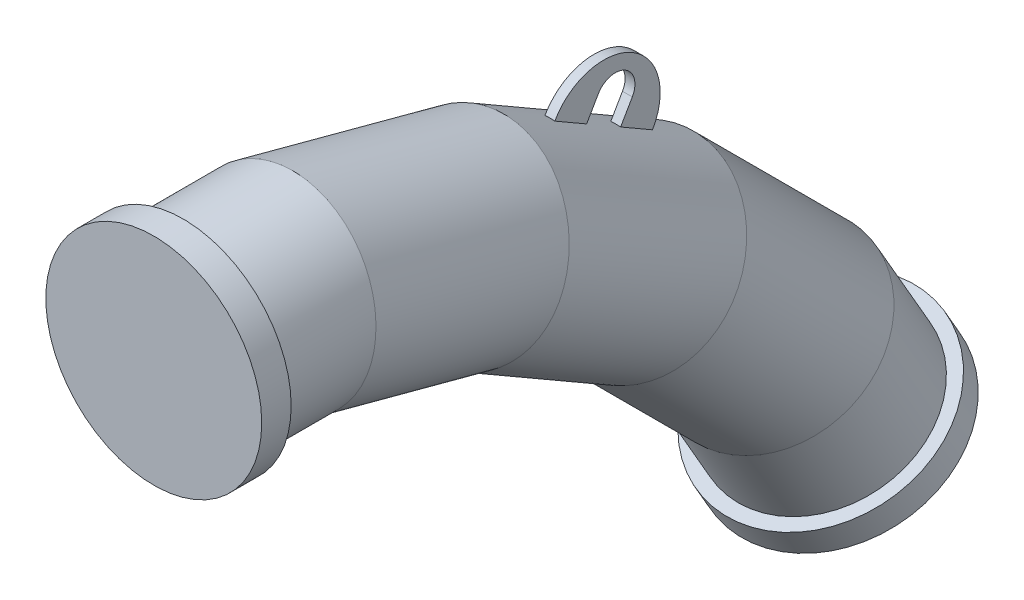
ISO-10303-21;
HEADER;
FILE_DESCRIPTION(('STEP AP214'),'2;1');
FILE_NAME('part.step','',(''),(''),'','','');
FILE_SCHEMA(('AUTOMOTIVE_DESIGN { 1 0 10303 214 1 1 1 1 }'));
ENDSEC;
DATA;
#1=APPLICATION_CONTEXT('core data for automotive mechanical design processes');
#2=APPLICATION_PROTOCOL_DEFINITION('international standard','automotive_design',2000,#1);
#3=PRODUCT_CONTEXT('',#1,'mechanical');
#4=PRODUCT('Part','Part','',(#3));
#5=PRODUCT_RELATED_PRODUCT_CATEGORY('part','',(#4));
#6=PRODUCT_DEFINITION_FORMATION('','',#4);
#7=PRODUCT_DEFINITION_CONTEXT('part definition',#1,'design');
#8=PRODUCT_DEFINITION('design','',#6,#7);
#9=PRODUCT_DEFINITION_SHAPE('','',#8);
#10=(LENGTH_UNIT() NAMED_UNIT(*) SI_UNIT(.MILLI.,.METRE.));
#11=(NAMED_UNIT(*) PLANE_ANGLE_UNIT() SI_UNIT($,.RADIAN.));
#12=(NAMED_UNIT(*) SI_UNIT($,.STERADIAN.) SOLID_ANGLE_UNIT());
#13=UNCERTAINTY_MEASURE_WITH_UNIT(LENGTH_MEASURE(1.E-05),#10,'distance_accuracy_value','');
#14=(GEOMETRIC_REPRESENTATION_CONTEXT(3) GLOBAL_UNCERTAINTY_ASSIGNED_CONTEXT((#13)) GLOBAL_UNIT_ASSIGNED_CONTEXT((#10,
#11,#12)) REPRESENTATION_CONTEXT('',''));
#15=CARTESIAN_POINT('',(0.,0.,0.));
#16=DIRECTION('',(0.,0.,1.));
#17=DIRECTION('',(1.,0.,0.));
#18=AXIS2_PLACEMENT_3D('',#15,#16,#17);
#19=CARTESIAN_POINT('',(0.,-400.980762113535,-694.519052838327));
#20=DIRECTION('',(0.,-0.866025403784441,-0.499999999999997));
#21=DIRECTION('',(-0.999999999999999,0.,0.));
#22=AXIS2_PLACEMENT_3D('',#19,#20,#21);
#23=PLANE('',#22);
#24=CARTESIAN_POINT('',(0.,-400.980762113535,-694.519052838327));
#25=DIRECTION('',(0.,-0.866025403784441,-0.499999999999997));
#26=DIRECTION('',(-0.999999999999999,0.,0.));
#27=AXIS2_PLACEMENT_3D('',#24,#25,#26);
#28=CIRCLE('',#27,110.);
#29=CARTESIAN_POINT('',(-110.,-400.980762113535,-694.519052838327));
#30=VERTEX_POINT('',#29);
#31=EDGE_CURVE('E20',#30,#30,#28,.T.);
#32=ORIENTED_EDGE('',*,*,#31,.T.);
#33=EDGE_LOOP('',(#32));
#34=FACE_BOUND('',#33,.T.);
#35=ADVANCED_FACE('F16',(#34),#23,.T.);
#36=CARTESIAN_POINT('',(0.,-375.000000000002,-679.519052838328));
#37=DIRECTION('',(0.,-0.866025403784441,-0.499999999999997));
#38=DIRECTION('',(-0.999999999999999,0.,0.));
#39=AXIS2_PLACEMENT_3D('',#36,#37,#38);
#40=CYLINDRICAL_SURFACE('',#39,110.);
#41=CARTESIAN_POINT('',(0.,-375.000000000002,-679.519052838328));
#42=DIRECTION('',(0.,-0.866025403784441,-0.499999999999997));
#43=DIRECTION('',(-0.999999999999999,0.,0.));
#44=AXIS2_PLACEMENT_3D('',#41,#42,#43);
#45=CIRCLE('',#44,110.);
#46=CARTESIAN_POINT('',(-110.,-375.000000000002,-679.519052838328));
#47=VERTEX_POINT('',#46);
#48=EDGE_CURVE('E26',#47,#47,#45,.T.);
#49=ORIENTED_EDGE('',*,*,#48,.T.);
#50=EDGE_LOOP('',(#49));
#51=FACE_BOUND('',#50,.T.);
#52=ORIENTED_EDGE('',*,*,#31,.F.);
#53=EDGE_LOOP('',(#52));
#54=FACE_BOUND('',#53,.T.);
#55=ADVANCED_FACE('F18',(#51,#54),#40,.T.);
#56=CARTESIAN_POINT('',(0.,-375.000000000002,-679.519052838328));
#57=DIRECTION('',(0.,-0.866025403784441,-0.499999999999997));
#58=DIRECTION('',(-0.999999999999999,0.,0.));
#59=AXIS2_PLACEMENT_3D('',#56,#57,#58);
#60=PLANE('',#59);
#61=CARTESIAN_POINT('',(0.,-375.000000000002,-679.519052838327));
#62=DIRECTION('',(0.,0.866025403784439,0.499999999999997));
#63=DIRECTION('',(1.,0.,0.));
#64=AXIS2_PLACEMENT_3D('',#61,#62,#63);
#65=CIRCLE('',#64,96.85);
#66=CARTESIAN_POINT('',(96.8499999999999,-375.000000000002,-679.519052838327));
#67=VERTEX_POINT('',#66);
#68=EDGE_CURVE('E10',#67,#67,#65,.T.);
#69=ORIENTED_EDGE('',*,*,#68,.F.);
#70=EDGE_LOOP('',(#69));
#71=FACE_BOUND('',#70,.T.);
#72=ORIENTED_EDGE('',*,*,#48,.F.);
#73=EDGE_LOOP('',(#72));
#74=FACE_BOUND('',#73,.T.);
#75=ADVANCED_FACE('F158',(#71,#74),#60,.F.);
#76=CARTESIAN_POINT('',(5.,3.8751139943531,-465.25));
#77=DIRECTION('',(1.,0.,0.));
#78=DIRECTION('',(0.,0.866025403784438,-0.500000000000001));
#79=AXIS2_PLACEMENT_3D('',#76,#77,#78);
#80=PLANE('',#79);
#81=DIRECTION('',(0.,0.866025403784438,-0.500000000000001));
#82=VECTOR('',#81,1.);
#83=CARTESIAN_POINT('',(5.00000000000002,3.61326296757457,-398.703539282395));
#84=LINE('',#83,#82);
#85=CARTESIAN_POINT('',(5.00000000000002,12.0317645601862,-403.563963443062));
#86=VERTEX_POINT('',#85);
#87=CARTESIAN_POINT('',(5.00000000000001,12.2735170054189,-403.703539282395));
#88=VERTEX_POINT('',#87);
#89=EDGE_CURVE('E120',#86,#88,#84,.T.);
#90=ORIENTED_EDGE('',*,*,#89,.F.);
#91=DIRECTION('',(0.,-0.500000000000001,-0.866025403784437));
#92=VECTOR('',#91,1.);
#93=CARTESIAN_POINT('',(5.00000000000005,32.6514511554609,-367.849618623899));
#94=LINE('',#93,#92);
#95=CARTESIAN_POINT('',(5.00000000000003,-6.71823543981404,-436.039916084979));
#96=VERTEX_POINT('',#95);
#97=EDGE_CURVE('E51',#86,#96,#94,.T.);
#98=ORIENTED_EDGE('',*,*,#97,.T.);
#99=DIRECTION('',(0.,0.866025403784438,-0.500000000000001));
#100=VECTOR('',#99,1.);
#101=CARTESIAN_POINT('',(5.00000000000001,-6.47648299458115,-436.179491924311));
#102=LINE('',#101,#100);
#103=CARTESIAN_POINT('',(5.00000000000001,13.8751139943533,-447.929491924311));
#104=VERTEX_POINT('',#103);
#105=EDGE_CURVE('E552',#96,#104,#102,.T.);
#106=ORIENTED_EDGE('',*,*,#105,.T.);
#107=CARTESIAN_POINT('',(5.,3.8751139943531,-465.25));
#108=DIRECTION('',(-1.,0.,0.));
#109=DIRECTION('',(0.,0.866025403784438,-0.500000000000001));
#110=AXIS2_PLACEMENT_3D('',#107,#108,#109);
#111=CIRCLE('',#110,20.);
#112=CARTESIAN_POINT('',(5.,-6.1248860056468,-482.570508075689));
#113=VERTEX_POINT('',#112);
#114=EDGE_CURVE('E559',#104,#113,#111,.T.);
#115=ORIENTED_EDGE('',*,*,#114,.T.);
#116=DIRECTION('',(0.,-0.866025403784438,0.500000000000001));
#117=VECTOR('',#116,1.);
#118=CARTESIAN_POINT('',(5.,-26.4764829945811,-470.820508075689));
#119=LINE('',#118,#117);
#120=CARTESIAN_POINT('',(5.00000000000003,-26.7182354398141,-470.680932236356));
#121=VERTEX_POINT('',#120);
#122=EDGE_CURVE('E573',#113,#121,#119,.T.);
#123=ORIENTED_EDGE('',*,*,#122,.T.);
#124=CARTESIAN_POINT('',(4.99999999999999,-45.4682354398142,-503.156884878273));
#125=VERTEX_POINT('',#124);
#126=EDGE_CURVE('E579',#121,#125,#94,.T.);
#127=ORIENTED_EDGE('',*,*,#126,.T.);
#128=DIRECTION('',(0.,0.866025403784438,-0.500000000000001));
#129=VECTOR('',#128,1.);
#130=CARTESIAN_POINT('',(4.99999999999999,-53.8867370324257,-498.296460717605));
#131=LINE('',#130,#129);
#132=CARTESIAN_POINT('',(4.99999999999999,-45.2264829945813,-503.296460717605));
#133=VERTEX_POINT('',#132);
#134=EDGE_CURVE('E119',#125,#133,#131,.T.);
#135=ORIENTED_EDGE('',*,*,#134,.T.);
#136=CARTESIAN_POINT('',(5.,-16.476482994581,-453.5));
#137=DIRECTION('',(1.,0.,0.));
#138=DIRECTION('',(0.,0.866025403784438,-0.500000000000001));
#139=AXIS2_PLACEMENT_3D('',#136,#137,#138);
#140=CIRCLE('',#139,57.5);
#141=EDGE_CURVE('E567',#133,#88,#140,.T.);
#142=ORIENTED_EDGE('',*,*,#141,.T.);
#143=EDGE_LOOP('',(#90,#98,#106,#115,#123,#127,#135,#142));
#144=FACE_BOUND('',#143,.T.);
#145=ADVANCED_FACE('F160',(#144),#80,.T.);
#146=CARTESIAN_POINT('',(-5.,3.8751139943531,-465.25));
#147=DIRECTION('',(1.,0.,0.));
#148=DIRECTION('',(0.,0.866025403784438,-0.500000000000001));
#149=AXIS2_PLACEMENT_3D('',#146,#147,#148);
#150=PLANE('',#149);
#151=DIRECTION('',(0.,-0.500000000000001,-0.866025403784437));
#152=VECTOR('',#151,1.);
#153=CARTESIAN_POINT('',(-4.99999999999995,32.6514511554609,-367.849618623899));
#154=LINE('',#153,#152);
#155=CARTESIAN_POINT('',(-4.99999999999999,12.0317645601862,-403.563963443062));
#156=VERTEX_POINT('',#155);
#157=CARTESIAN_POINT('',(-4.99999999999997,-6.71823543981404,-436.039916084979));
#158=VERTEX_POINT('',#157);
#159=EDGE_CURVE('E124',#156,#158,#154,.T.);
#160=ORIENTED_EDGE('',*,*,#159,.F.);
#161=DIRECTION('',(0.,0.866025403784438,-0.500000000000001));
#162=VECTOR('',#161,1.);
#163=CARTESIAN_POINT('',(-4.99999999999999,3.61326296757457,-398.703539282395));
#164=LINE('',#163,#162);
#165=CARTESIAN_POINT('',(-4.99999999999999,12.2735170054189,-403.703539282395));
#166=VERTEX_POINT('',#165);
#167=EDGE_CURVE('E108',#156,#166,#164,.T.);
#168=ORIENTED_EDGE('',*,*,#167,.T.);
#169=CARTESIAN_POINT('',(-5.,-16.476482994581,-453.5));
#170=DIRECTION('',(1.,0.,0.));
#171=DIRECTION('',(0.,0.866025403784438,-0.500000000000001));
#172=AXIS2_PLACEMENT_3D('',#169,#170,#171);
#173=CIRCLE('',#172,57.5);
#174=CARTESIAN_POINT('',(-5.00000000000001,-45.2264829945813,-503.296460717605));
#175=VERTEX_POINT('',#174);
#176=EDGE_CURVE('E546',#175,#166,#173,.T.);
#177=ORIENTED_EDGE('',*,*,#176,.F.);
#178=DIRECTION('',(0.,0.866025403784438,-0.500000000000001));
#179=VECTOR('',#178,1.);
#180=CARTESIAN_POINT('',(-5.00000000000001,-53.8867370324257,-498.296460717605));
#181=LINE('',#180,#179);
#182=CARTESIAN_POINT('',(-5.00000000000001,-45.4682354398142,-503.156884878273));
#183=VERTEX_POINT('',#182);
#184=EDGE_CURVE('E576',#183,#175,#181,.T.);
#185=ORIENTED_EDGE('',*,*,#184,.F.);
#186=CARTESIAN_POINT('',(-4.99999999999997,-26.7182354398141,-470.680932236356));
#187=VERTEX_POINT('',#186);
#188=EDGE_CURVE('E133',#187,#183,#154,.T.);
#189=ORIENTED_EDGE('',*,*,#188,.F.);
#190=DIRECTION('',(0.,-0.866025403784438,0.500000000000001));
#191=VECTOR('',#190,1.);
#192=CARTESIAN_POINT('',(-5.,-26.4764829945811,-470.820508075689));
#193=LINE('',#192,#191);
#194=CARTESIAN_POINT('',(-5.,-6.1248860056468,-482.570508075689));
#195=VERTEX_POINT('',#194);
#196=EDGE_CURVE('E553',#195,#187,#193,.T.);
#197=ORIENTED_EDGE('',*,*,#196,.F.);
#198=CARTESIAN_POINT('',(-5.,3.8751139943531,-465.25));
#199=DIRECTION('',(-1.,0.,0.));
#200=DIRECTION('',(0.,0.866025403784438,-0.500000000000001));
#201=AXIS2_PLACEMENT_3D('',#198,#199,#200);
#202=CIRCLE('',#201,20.);
#203=CARTESIAN_POINT('',(-4.99999999999999,13.8751139943532,-447.929491924312));
#204=VERTEX_POINT('',#203);
#205=EDGE_CURVE('E561',#204,#195,#202,.T.);
#206=ORIENTED_EDGE('',*,*,#205,.F.);
#207=DIRECTION('',(0.,0.866025403784438,-0.500000000000001));
#208=VECTOR('',#207,1.);
#209=CARTESIAN_POINT('',(-4.99999999999999,-6.47648299458117,-436.179491924311));
#210=LINE('',#209,#208);
#211=EDGE_CURVE('E127',#158,#204,#210,.T.);
#212=ORIENTED_EDGE('',*,*,#211,.F.);
#213=EDGE_LOOP('',(#160,#168,#177,#185,#189,#197,#206,#212));
#214=FACE_BOUND('',#213,.T.);
#215=ADVANCED_FACE('F125',(#214),#150,.F.);
#216=CARTESIAN_POINT('',(5.00000000000001,-6.47648299458115,-436.179491924311));
#217=DIRECTION('',(0.,0.500000000000001,0.866025403784438));
#218=DIRECTION('',(0.,-0.866025403784438,0.500000000000001));
#219=AXIS2_PLACEMENT_3D('',#216,#217,#218);
#220=PLANE('',#219);
#221=CARTESIAN_POINT('',(-1.01043121632866E-13,-90.4809471616773,-387.679491924308));
#222=DIRECTION('',(0.,0.500000000000001,0.866025403784438));
#223=DIRECTION('',(0.,-0.866025403784438,0.500000000000001));
#224=AXIS2_PLACEMENT_3D('',#221,#222,#223);
#225=CIRCLE('',#224,96.85);
#226=EDGE_CURVE('E586',#158,#96,#225,.F.);
#227=ORIENTED_EDGE('',*,*,#226,.F.);
#228=ORIENTED_EDGE('',*,*,#211,.T.);
#229=DIRECTION('',(-1.,0.,0.));
#230=VECTOR('',#229,1.);
#231=CARTESIAN_POINT('',(5.00000000000001,13.8751139943533,-447.929491924311));
#232=LINE('',#231,#230);
#233=EDGE_CURVE('E137',#104,#204,#232,.T.);
#234=ORIENTED_EDGE('',*,*,#233,.F.);
#235=ORIENTED_EDGE('',*,*,#105,.F.);
#236=EDGE_LOOP('',(#227,#228,#234,#235));
#237=FACE_BOUND('',#236,.T.);
#238=ADVANCED_FACE('F321',(#237),#220,.F.);
#239=CARTESIAN_POINT('',(5.,3.8751139943531,-465.25));
#240=DIRECTION('',(-1.,0.,0.));
#241=DIRECTION('',(0.,-0.866025403784438,0.500000000000001));
#242=AXIS2_PLACEMENT_3D('',#239,#240,#241);
#243=CYLINDRICAL_SURFACE('',#242,20.);
#244=ORIENTED_EDGE('',*,*,#205,.T.);
#245=DIRECTION('',(-1.,0.,0.));
#246=VECTOR('',#245,1.);
#247=CARTESIAN_POINT('',(5.,-6.1248860056468,-482.570508075689));
#248=LINE('',#247,#246);
#249=EDGE_CURVE('E147',#113,#195,#248,.T.);
#250=ORIENTED_EDGE('',*,*,#249,.F.);
#251=ORIENTED_EDGE('',*,*,#114,.F.);
#252=ORIENTED_EDGE('',*,*,#233,.T.);
#253=EDGE_LOOP('',(#244,#250,#251,#252));
#254=FACE_BOUND('',#253,.T.);
#255=ADVANCED_FACE('F311',(#254),#243,.F.);
#256=CARTESIAN_POINT('',(5.,-26.4764829945811,-470.820508075689));
#257=DIRECTION('',(0.,-0.500000000000001,-0.866025403784438));
#258=DIRECTION('',(0.,0.866025403784438,-0.500000000000001));
#259=AXIS2_PLACEMENT_3D('',#256,#257,#258);
#260=PLANE('',#259);
#261=CARTESIAN_POINT('',(0.,-110.480947161677,-422.320508075685));
#262=DIRECTION('',(0.,-0.500000000000001,-0.866025403784438));
#263=DIRECTION('',(0.,0.866025403784438,-0.500000000000001));
#264=AXIS2_PLACEMENT_3D('',#261,#262,#263);
#265=CIRCLE('',#264,96.85);
#266=EDGE_CURVE('E39',#121,#187,#265,.F.);
#267=ORIENTED_EDGE('',*,*,#266,.F.);
#268=ORIENTED_EDGE('',*,*,#122,.F.);
#269=ORIENTED_EDGE('',*,*,#249,.T.);
#270=ORIENTED_EDGE('',*,*,#196,.T.);
#271=EDGE_LOOP('',(#267,#268,#269,#270));
#272=FACE_BOUND('',#271,.T.);
#273=ADVANCED_FACE('F309',(#272),#260,.F.);
#274=CARTESIAN_POINT('',(5.,-16.476482994581,-453.5));
#275=DIRECTION('',(-1.,0.,0.));
#276=DIRECTION('',(0.,-0.866025403784438,0.500000000000001));
#277=AXIS2_PLACEMENT_3D('',#274,#275,#276);
#278=CYLINDRICAL_SURFACE('',#277,57.5);
#279=ORIENTED_EDGE('',*,*,#176,.T.);
#280=DIRECTION('',(-1.,0.,0.));
#281=VECTOR('',#280,1.);
#282=CARTESIAN_POINT('',(5.00000000000001,12.2735170054189,-403.703539282395));
#283=LINE('',#282,#281);
#284=EDGE_CURVE('E114',#88,#166,#283,.T.);
#285=ORIENTED_EDGE('',*,*,#284,.F.);
#286=ORIENTED_EDGE('',*,*,#141,.F.);
#287=DIRECTION('',(-1.,0.,0.));
#288=VECTOR('',#287,1.);
#289=CARTESIAN_POINT('',(4.99999999999999,-45.2264829945813,-503.296460717605));
#290=LINE('',#289,#288);
#291=EDGE_CURVE('E549',#133,#175,#290,.T.);
#292=ORIENTED_EDGE('',*,*,#291,.T.);
#293=EDGE_LOOP('',(#279,#285,#286,#292));
#294=FACE_BOUND('',#293,.T.);
#295=ADVANCED_FACE('F204',(#294),#278,.T.);
#296=CARTESIAN_POINT('',(-5.00000000000001,-53.8867370324257,-498.296460717605));
#297=DIRECTION('',(0.,0.500000000000001,0.866025403784438));
#298=DIRECTION('',(0.,-0.866025403784438,0.500000000000001));
#299=AXIS2_PLACEMENT_3D('',#296,#297,#298);
#300=PLANE('',#299);
#301=CARTESIAN_POINT('',(0.,-129.230947161678,-454.796460717602));
#302=DIRECTION('',(0.,0.500000000000001,0.866025403784438));
#303=DIRECTION('',(0.,-0.866025403784438,0.500000000000001));
#304=AXIS2_PLACEMENT_3D('',#301,#302,#303);
#305=CIRCLE('',#304,96.85);
#306=EDGE_CURVE('E580',#183,#125,#305,.F.);
#307=ORIENTED_EDGE('',*,*,#306,.F.);
#308=ORIENTED_EDGE('',*,*,#184,.T.);
#309=ORIENTED_EDGE('',*,*,#291,.F.);
#310=ORIENTED_EDGE('',*,*,#134,.F.);
#311=EDGE_LOOP('',(#307,#308,#309,#310));
#312=FACE_BOUND('',#311,.T.);
#313=ADVANCED_FACE('F208',(#312),#300,.F.);
#314=CARTESIAN_POINT('',(5.00000000000002,3.61326296757457,-398.703539282395));
#315=DIRECTION('',(0.,-0.500000000000001,-0.866025403784438));
#316=DIRECTION('',(0.,0.866025403784438,-0.500000000000001));
#317=AXIS2_PLACEMENT_3D('',#314,#315,#316);
#318=PLANE('',#317);
#319=CARTESIAN_POINT('',(-1.04568404931757E-13,-71.7309471616772,-355.203539282391));
#320=DIRECTION('',(0.,-0.500000000000001,-0.866025403784438));
#321=DIRECTION('',(0.,0.866025403784438,-0.500000000000001));
#322=AXIS2_PLACEMENT_3D('',#319,#320,#321);
#323=CIRCLE('',#322,96.85);
#324=EDGE_CURVE('E112',#86,#156,#323,.F.);
#325=ORIENTED_EDGE('',*,*,#324,.F.);
#326=ORIENTED_EDGE('',*,*,#89,.T.);
#327=ORIENTED_EDGE('',*,*,#284,.T.);
#328=ORIENTED_EDGE('',*,*,#167,.F.);
#329=EDGE_LOOP('',(#325,#326,#327,#328));
#330=FACE_BOUND('',#329,.T.);
#331=ADVANCED_FACE('F110',(#330),#318,.F.);
#332=CARTESIAN_POINT('',(-1.08445217560168E-13,-51.1112605664023,-319.489194463229));
#333=DIRECTION('',(0.,-0.500000000000001,-0.866025403784437));
#334=DIRECTION('',(0.,-0.86602540378444,0.500000000000001));
#335=AXIS2_PLACEMENT_3D('',#332,#333,#334);
#336=CYLINDRICAL_SURFACE('',#335,96.85);
#337=CARTESIAN_POINT('',(-1.08445217560168E-13,-51.1112605664023,-319.489194463229));
#338=DIRECTION('',(0.,0.38268343236509,0.923879532511286));
#339=DIRECTION('',(0.,-0.923879532511289,0.38268343236509));
#340=AXIS2_PLACEMENT_3D('',#337,#338,#339);
#341=ELLIPSE('',#340,97.6857148321878,96.85);
#342=CARTESIAN_POINT('',(-1.12947077523171E-13,-141.361093118595,-282.10648981821));
#343=VERTEX_POINT('',#342);
#344=EDGE_CURVE('E647',#343,#343,#341,.T.);
#345=ORIENTED_EDGE('',*,*,#344,.F.);
#346=EDGE_LOOP('',(#345));
#347=FACE_BOUND('',#346,.T.);
#348=CARTESIAN_POINT('',(0.,-149.850633756946,-490.510805536764));
#349=DIRECTION('',(0.,0.608761429008722,0.793353340291234));
#350=DIRECTION('',(0.,-0.793353340291236,0.608761429008722));
#351=AXIS2_PLACEMENT_3D('',#348,#349,#350);
#352=ELLIPSE('',#351,97.6857148321878,96.85);
#353=CARTESIAN_POINT('',(0.,-227.349921917799,-431.043510181783));
#354=VERTEX_POINT('',#353);
#355=EDGE_CURVE('E643',#354,#354,#352,.T.);
#356=ORIENTED_EDGE('',*,*,#355,.T.);
#357=EDGE_LOOP('',(#356));
#358=FACE_BOUND('',#357,.T.);
#359=ORIENTED_EDGE('',*,*,#159,.T.);
#360=ORIENTED_EDGE('',*,*,#226,.T.);
#361=ORIENTED_EDGE('',*,*,#97,.F.);
#362=ORIENTED_EDGE('',*,*,#324,.T.);
#363=EDGE_LOOP('',(#359,#360,#361,#362));
#364=FACE_BOUND('',#363,.T.);
#365=ORIENTED_EDGE('',*,*,#126,.F.);
#366=ORIENTED_EDGE('',*,*,#266,.T.);
#367=ORIENTED_EDGE('',*,*,#188,.T.);
#368=ORIENTED_EDGE('',*,*,#306,.T.);
#369=EDGE_LOOP('',(#365,#366,#367,#368));
#370=FACE_BOUND('',#369,.T.);
#371=ADVANCED_FACE('F134',(#347,#358,#364,#370),#336,.T.);
#372=CARTESIAN_POINT('',(0.,4.57966997657877E-13,-29.9999999999996));
#373=DIRECTION('',(0.,0.,1.));
#374=DIRECTION('',(0.999999999999999,0.,0.));
#375=AXIS2_PLACEMENT_3D('',#372,#373,#374);
#376=CYLINDRICAL_SURFACE('',#375,110.);
#377=CARTESIAN_POINT('',(0.,4.57966997657877E-13,-29.9999999999996));
#378=DIRECTION('',(0.,0.,1.));
#379=DIRECTION('',(0.999999999999999,0.,0.));
#380=AXIS2_PLACEMENT_3D('',#377,#378,#379);
#381=CIRCLE('',#380,110.);
#382=CARTESIAN_POINT('',(110.,4.24795949044683E-13,-29.9999999999996));
#383=VERTEX_POINT('',#382);
#384=EDGE_CURVE('E668',#383,#383,#381,.T.);
#385=ORIENTED_EDGE('',*,*,#384,.T.);
#386=EDGE_LOOP('',(#385));
#387=FACE_BOUND('',#386,.T.);
#388=CARTESIAN_POINT('',(0.,0.,0.));
#389=DIRECTION('',(0.,0.,1.));
#390=DIRECTION('',(0.999999999999999,0.,0.));
#391=AXIS2_PLACEMENT_3D('',#388,#389,#390);
#392=CIRCLE('',#391,110.);
#393=CARTESIAN_POINT('',(110.,0.,0.));
#394=VERTEX_POINT('',#393);
#395=EDGE_CURVE('E589',#394,#394,#392,.T.);
#396=ORIENTED_EDGE('',*,*,#395,.F.);
#397=EDGE_LOOP('',(#396));
#398=FACE_BOUND('',#397,.T.);
#399=ADVANCED_FACE('F237',(#387,#398),#376,.T.);
#400=CARTESIAN_POINT('',(0.,4.57966997657877E-13,-29.9999999999996));
#401=DIRECTION('',(0.,0.,1.));
#402=DIRECTION('',(0.999999999999999,0.,0.));
#403=AXIS2_PLACEMENT_3D('',#400,#401,#402);
#404=PLANE('',#403);
#405=CARTESIAN_POINT('',(0.,0.,-29.9999999999989));
#406=DIRECTION('',(0.,0.,-0.999999999999999));
#407=DIRECTION('',(-1.,0.,0.));
#408=AXIS2_PLACEMENT_3D('',#405,#406,#407);
#409=CIRCLE('',#408,96.85);
#410=CARTESIAN_POINT('',(-96.85,0.,-29.9999999999989));
#411=VERTEX_POINT('',#410);
#412=EDGE_CURVE('E131',#411,#411,#409,.T.);
#413=ORIENTED_EDGE('',*,*,#412,.F.);
#414=EDGE_LOOP('',(#413));
#415=FACE_BOUND('',#414,.T.);
#416=ORIENTED_EDGE('',*,*,#384,.F.);
#417=EDGE_LOOP('',(#416));
#418=FACE_BOUND('',#417,.T.);
#419=ADVANCED_FACE('F248',(#415,#418),#404,.F.);
#420=CARTESIAN_POINT('',(0.,-289.489194463236,-630.149366243054));
#421=DIRECTION('',(0.,-0.866025403784439,-0.499999999999997));
#422=DIRECTION('',(-1.,0.,0.));
#423=AXIS2_PLACEMENT_3D('',#420,#421,#422);
#424=CYLINDRICAL_SURFACE('',#423,96.85);
#425=ORIENTED_EDGE('',*,*,#68,.T.);
#426=EDGE_LOOP('',(#425));
#427=FACE_BOUND('',#426,.T.);
#428=CARTESIAN_POINT('',(0.,-289.489194463236,-630.149366243054));
#429=DIRECTION('',(0.,0.793353340291236,0.608761429008718));
#430=DIRECTION('',(0.,-0.608761429008719,0.793353340291236));
#431=AXIS2_PLACEMENT_3D('',#428,#429,#430);
#432=ELLIPSE('',#431,97.6857148321878,96.85);
#433=CARTESIAN_POINT('',(0.,-348.956489818217,-552.650078082201));
#434=VERTEX_POINT('',#433);
#435=EDGE_CURVE('E646',#434,#434,#432,.T.);
#436=ORIENTED_EDGE('',*,*,#435,.F.);
#437=EDGE_LOOP('',(#436));
#438=FACE_BOUND('',#437,.T.);
#439=ADVANCED_FACE('F259',(#427,#438),#424,.T.);
#440=CARTESIAN_POINT('',(0.,-149.850633756946,-490.510805536764));
#441=DIRECTION('',(0.,-0.707106781186549,-0.707106781186545));
#442=DIRECTION('',(0.,-0.707106781186548,0.70710678118655));
#443=AXIS2_PLACEMENT_3D('',#440,#441,#442);
#444=CYLINDRICAL_SURFACE('',#443,96.85);
#445=ORIENTED_EDGE('',*,*,#355,.F.);
#446=EDGE_LOOP('',(#445));
#447=FACE_BOUND('',#446,.T.);
#448=ORIENTED_EDGE('',*,*,#435,.T.);
#449=EDGE_LOOP('',(#448));
#450=FACE_BOUND('',#449,.T.);
#451=ADVANCED_FACE('F270',(#447,#450),#444,.T.);
#452=CARTESIAN_POINT('',(0.,-51.1112605663978,-319.489194463234));
#453=DIRECTION('',(0.,0.25881904510252,0.965925826289067));
#454=DIRECTION('',(0.,-0.96592582628907,0.258819045102522));
#455=AXIS2_PLACEMENT_3D('',#452,#453,#454);
#456=CYLINDRICAL_SURFACE('',#455,96.85);
#457=ORIENTED_EDGE('',*,*,#344,.T.);
#458=EDGE_LOOP('',(#457));
#459=FACE_BOUND('',#458,.T.);
#460=CARTESIAN_POINT('',(0.,0.,-128.739373190546));
#461=DIRECTION('',(0.,0.130526192220051,0.99144486137381));
#462=DIRECTION('',(0.,0.991444861373811,-0.130526192220053));
#463=AXIS2_PLACEMENT_3D('',#460,#461,#462);
#464=ELLIPSE('',#463,97.6857148321878,96.85);
#465=CARTESIAN_POINT('',(0.,96.8500000000001,-141.489917581885));
#466=VERTEX_POINT('',#465);
#467=EDGE_CURVE('E685',#466,#466,#464,.T.);
#468=ORIENTED_EDGE('',*,*,#467,.F.);
#469=EDGE_LOOP('',(#468));
#470=FACE_BOUND('',#469,.T.);
#471=ADVANCED_FACE('F282',(#459,#470),#456,.T.);
#472=CARTESIAN_POINT('',(0.,3.33066907387547E-13,-128.739373190546));
#473=DIRECTION('',(0.,0.,0.999999999999999));
#474=DIRECTION('',(1.,0.,0.));
#475=AXIS2_PLACEMENT_3D('',#472,#473,#474);
#476=CYLINDRICAL_SURFACE('',#475,96.85);
#477=ORIENTED_EDGE('',*,*,#412,.T.);
#478=EDGE_LOOP('',(#477));
#479=FACE_BOUND('',#478,.T.);
#480=ORIENTED_EDGE('',*,*,#467,.T.);
#481=EDGE_LOOP('',(#480));
#482=FACE_BOUND('',#481,.T.);
#483=ADVANCED_FACE('F186',(#479,#482),#476,.T.);
#484=CARTESIAN_POINT('',(0.,0.,0.));
#485=DIRECTION('',(0.,0.,1.));
#486=DIRECTION('',(0.999999999999999,0.,0.));
#487=AXIS2_PLACEMENT_3D('',#484,#485,#486);
#488=PLANE('',#487);
#489=ORIENTED_EDGE('',*,*,#395,.T.);
#490=EDGE_LOOP('',(#489));
#491=FACE_BOUND('',#490,.T.);
#492=ADVANCED_FACE('F190',(#491),#488,.T.);
#493=CLOSED_SHELL('',(#35,#55,#75,#145,#215,#238,#255,#273,#295,#313,#331,#371,#399,#419,#439,
#451,#471,#483,#492));
#494=MANIFOLD_SOLID_BREP('B1',#493);
#495=ADVANCED_BREP_SHAPE_REPRESENTATION('',(#18,#494),#14);
#496=SHAPE_DEFINITION_REPRESENTATION(#9,#495);
ENDSEC;
END-ISO-10303-21;
